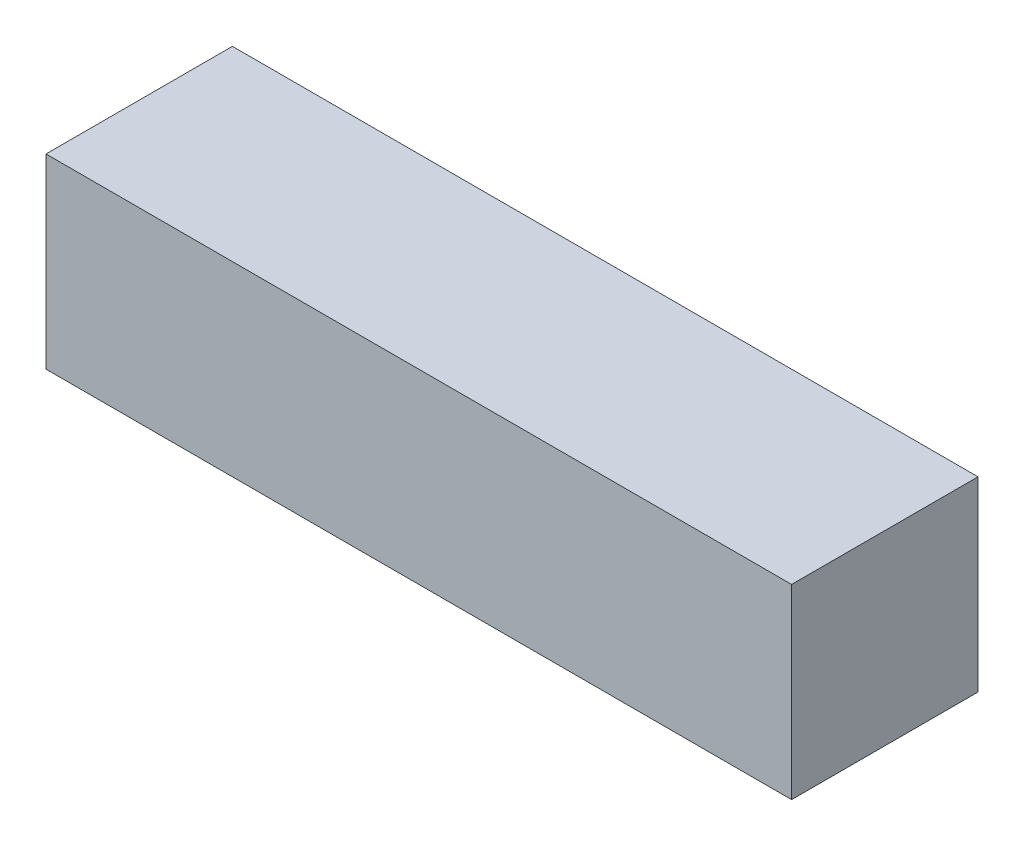
ISO-10303-21;
HEADER;
FILE_DESCRIPTION(('STEP AP214'),'2;1');
FILE_NAME('part.step','',(''),(''),'','','');
FILE_SCHEMA(('AUTOMOTIVE_DESIGN { 1 0 10303 214 1 1 1 1 }'));
ENDSEC;
DATA;
#1=APPLICATION_CONTEXT('core data for automotive mechanical design processes');
#2=APPLICATION_PROTOCOL_DEFINITION('international standard','automotive_design',2000,#1);
#3=PRODUCT_CONTEXT('',#1,'mechanical');
#4=PRODUCT('Part','Part','',(#3));
#5=PRODUCT_RELATED_PRODUCT_CATEGORY('part','',(#4));
#6=PRODUCT_DEFINITION_FORMATION('','',#4);
#7=PRODUCT_DEFINITION_CONTEXT('part definition',#1,'design');
#8=PRODUCT_DEFINITION('design','',#6,#7);
#9=PRODUCT_DEFINITION_SHAPE('','',#8);
#10=(LENGTH_UNIT() NAMED_UNIT(*) SI_UNIT(.MILLI.,.METRE.));
#11=(NAMED_UNIT(*) PLANE_ANGLE_UNIT() SI_UNIT($,.RADIAN.));
#12=(NAMED_UNIT(*) SI_UNIT($,.STERADIAN.) SOLID_ANGLE_UNIT());
#13=UNCERTAINTY_MEASURE_WITH_UNIT(LENGTH_MEASURE(1.E-05),#10,'distance_accuracy_value','');
#14=(GEOMETRIC_REPRESENTATION_CONTEXT(3) GLOBAL_UNCERTAINTY_ASSIGNED_CONTEXT((#13)) GLOBAL_UNIT_ASSIGNED_CONTEXT((#10,
#11,#12)) REPRESENTATION_CONTEXT('',''));
#15=CARTESIAN_POINT('',(0.,0.,0.));
#16=DIRECTION('',(0.,0.,1.));
#17=DIRECTION('',(1.,0.,0.));
#18=AXIS2_PLACEMENT_3D('',#15,#16,#17);
#19=CARTESIAN_POINT('',(19.05,4.7625,4.7625));
#20=DIRECTION('',(0.,0.,-1.));
#21=DIRECTION('',(-1.,0.,0.));
#22=AXIS2_PLACEMENT_3D('',#19,#20,#21);
#23=PLANE('',#22);
#24=DIRECTION('',(0.,-1.,0.));
#25=VECTOR('',#24,1.);
#26=CARTESIAN_POINT('',(-19.05,4.7625,4.7625));
#27=LINE('',#26,#25);
#28=CARTESIAN_POINT('',(-19.05,4.7625,4.7625));
#29=VERTEX_POINT('',#28);
#30=CARTESIAN_POINT('',(-19.05,-4.7625,4.7625));
#31=VERTEX_POINT('',#30);
#32=EDGE_CURVE('E108',#29,#31,#27,.T.);
#33=ORIENTED_EDGE('',*,*,#32,.T.);
#34=DIRECTION('',(-1.,0.,0.));
#35=VECTOR('',#34,1.);
#36=CARTESIAN_POINT('',(19.05,-4.7625,4.7625));
#37=LINE('',#36,#35);
#38=CARTESIAN_POINT('',(19.05,-4.7625,4.7625));
#39=VERTEX_POINT('',#38);
#40=EDGE_CURVE('E11',#39,#31,#37,.T.);
#41=ORIENTED_EDGE('',*,*,#40,.F.);
#42=DIRECTION('',(0.,-1.,0.));
#43=VECTOR('',#42,1.);
#44=CARTESIAN_POINT('',(19.05,4.7625,4.7625));
#45=LINE('',#44,#43);
#46=CARTESIAN_POINT('',(19.05,4.7625,4.7625));
#47=VERTEX_POINT('',#46);
#48=EDGE_CURVE('E96',#47,#39,#45,.T.);
#49=ORIENTED_EDGE('',*,*,#48,.F.);
#50=DIRECTION('',(-1.,0.,0.));
#51=VECTOR('',#50,1.);
#52=CARTESIAN_POINT('',(19.05,4.7625,4.7625));
#53=LINE('',#52,#51);
#54=EDGE_CURVE('E104',#47,#29,#53,.T.);
#55=ORIENTED_EDGE('',*,*,#54,.T.);
#56=EDGE_LOOP('',(#33,#41,#49,#55));
#57=FACE_BOUND('',#56,.T.);
#58=ADVANCED_FACE('F45',(#57),#23,.F.);
#59=CARTESIAN_POINT('',(19.05,-4.7625,4.7625));
#60=DIRECTION('',(0.,1.,0.));
#61=DIRECTION('',(0.,0.,1.));
#62=AXIS2_PLACEMENT_3D('',#59,#60,#61);
#63=PLANE('',#62);
#64=DIRECTION('',(0.,0.,-1.));
#65=VECTOR('',#64,1.);
#66=CARTESIAN_POINT('',(-19.05,-4.7625,4.7625));
#67=LINE('',#66,#65);
#68=CARTESIAN_POINT('',(-19.05,-4.7625,-4.7625));
#69=VERTEX_POINT('',#68);
#70=EDGE_CURVE('E100',#31,#69,#67,.T.);
#71=ORIENTED_EDGE('',*,*,#70,.T.);
#72=DIRECTION('',(-1.,0.,0.));
#73=VECTOR('',#72,1.);
#74=CARTESIAN_POINT('',(19.05,-4.7625,-4.7625));
#75=LINE('',#74,#73);
#76=CARTESIAN_POINT('',(19.05,-4.7625,-4.7625));
#77=VERTEX_POINT('',#76);
#78=EDGE_CURVE('E53',#77,#69,#75,.T.);
#79=ORIENTED_EDGE('',*,*,#78,.F.);
#80=DIRECTION('',(0.,0.,-1.));
#81=VECTOR('',#80,1.);
#82=CARTESIAN_POINT('',(19.05,-4.7625,4.7625));
#83=LINE('',#82,#81);
#84=EDGE_CURVE('E91',#39,#77,#83,.T.);
#85=ORIENTED_EDGE('',*,*,#84,.F.);
#86=ORIENTED_EDGE('',*,*,#40,.T.);
#87=EDGE_LOOP('',(#71,#79,#85,#86));
#88=FACE_BOUND('',#87,.T.);
#89=ADVANCED_FACE('F99',(#88),#63,.F.);
#90=CARTESIAN_POINT('',(19.05,4.7625,-4.7625));
#91=DIRECTION('',(0.,0.,1.));
#92=DIRECTION('',(1.,0.,0.));
#93=AXIS2_PLACEMENT_3D('',#90,#91,#92);
#94=PLANE('',#93);
#95=DIRECTION('',(0.,1.,0.));
#96=VECTOR('',#95,1.);
#97=CARTESIAN_POINT('',(-19.05,4.7625,-4.7625));
#98=LINE('',#97,#96);
#99=CARTESIAN_POINT('',(-19.05,4.7625,-4.7625));
#100=VERTEX_POINT('',#99);
#101=EDGE_CURVE('E78',#69,#100,#98,.T.);
#102=ORIENTED_EDGE('',*,*,#101,.T.);
#103=DIRECTION('',(-1.,0.,0.));
#104=VECTOR('',#103,1.);
#105=CARTESIAN_POINT('',(19.05,4.7625,-4.7625));
#106=LINE('',#105,#104);
#107=CARTESIAN_POINT('',(19.05,4.7625,-4.7625));
#108=VERTEX_POINT('',#107);
#109=EDGE_CURVE('E101',#108,#100,#106,.T.);
#110=ORIENTED_EDGE('',*,*,#109,.F.);
#111=DIRECTION('',(0.,1.,0.));
#112=VECTOR('',#111,1.);
#113=CARTESIAN_POINT('',(19.05,4.7625,-4.7625));
#114=LINE('',#113,#112);
#115=EDGE_CURVE('E94',#77,#108,#114,.T.);
#116=ORIENTED_EDGE('',*,*,#115,.F.);
#117=ORIENTED_EDGE('',*,*,#78,.T.);
#118=EDGE_LOOP('',(#102,#110,#116,#117));
#119=FACE_BOUND('',#118,.T.);
#120=ADVANCED_FACE('F102',(#119),#94,.F.);
#121=CARTESIAN_POINT('',(19.05,4.7625,4.7625));
#122=DIRECTION('',(0.,-1.,0.));
#123=DIRECTION('',(0.,0.,-1.));
#124=AXIS2_PLACEMENT_3D('',#121,#122,#123);
#125=PLANE('',#124);
#126=DIRECTION('',(0.,0.,1.));
#127=VECTOR('',#126,1.);
#128=CARTESIAN_POINT('',(-19.05,4.7625,4.7625));
#129=LINE('',#128,#127);
#130=EDGE_CURVE('E84',#100,#29,#129,.T.);
#131=ORIENTED_EDGE('',*,*,#130,.T.);
#132=ORIENTED_EDGE('',*,*,#54,.F.);
#133=DIRECTION('',(0.,0.,1.));
#134=VECTOR('',#133,1.);
#135=CARTESIAN_POINT('',(19.05,4.7625,4.7625));
#136=LINE('',#135,#134);
#137=EDGE_CURVE('E61',#108,#47,#136,.T.);
#138=ORIENTED_EDGE('',*,*,#137,.F.);
#139=ORIENTED_EDGE('',*,*,#109,.T.);
#140=EDGE_LOOP('',(#131,#132,#138,#139));
#141=FACE_BOUND('',#140,.T.);
#142=ADVANCED_FACE('F115',(#141),#125,.F.);
#143=CARTESIAN_POINT('',(19.05,0.,0.));
#144=DIRECTION('',(1.,0.,0.));
#145=DIRECTION('',(0.,0.,-1.));
#146=AXIS2_PLACEMENT_3D('',#143,#144,#145);
#147=PLANE('',#146);
#148=ORIENTED_EDGE('',*,*,#48,.T.);
#149=ORIENTED_EDGE('',*,*,#84,.T.);
#150=ORIENTED_EDGE('',*,*,#115,.T.);
#151=ORIENTED_EDGE('',*,*,#137,.T.);
#152=EDGE_LOOP('',(#148,#149,#150,#151));
#153=FACE_BOUND('',#152,.T.);
#154=ADVANCED_FACE('F92',(#153),#147,.T.);
#155=CARTESIAN_POINT('',(-19.05,0.,0.));
#156=DIRECTION('',(1.,0.,0.));
#157=DIRECTION('',(0.,0.,-1.));
#158=AXIS2_PLACEMENT_3D('',#155,#156,#157);
#159=PLANE('',#158);
#160=ORIENTED_EDGE('',*,*,#32,.F.);
#161=ORIENTED_EDGE('',*,*,#130,.F.);
#162=ORIENTED_EDGE('',*,*,#101,.F.);
#163=ORIENTED_EDGE('',*,*,#70,.F.);
#164=EDGE_LOOP('',(#160,#161,#162,#163));
#165=FACE_BOUND('',#164,.T.);
#166=ADVANCED_FACE('F118',(#165),#159,.F.);
#167=CLOSED_SHELL('',(#58,#89,#120,#142,#154,#166));
#168=MANIFOLD_SOLID_BREP('B2',#167);
#169=ADVANCED_BREP_SHAPE_REPRESENTATION('',(#18,#168),#14);
#170=SHAPE_DEFINITION_REPRESENTATION(#9,#169);
ENDSEC;
END-ISO-10303-21;
